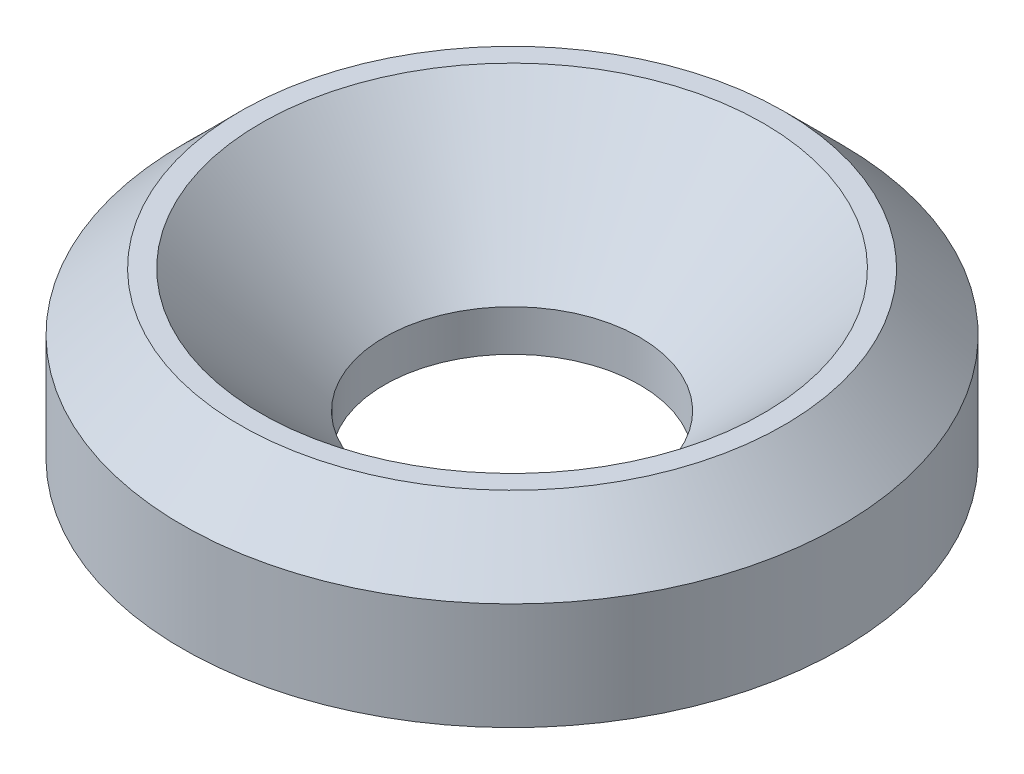
ISO-10303-21;
HEADER;
FILE_DESCRIPTION(('STEP AP214'),'2;1');
FILE_NAME('part.step','',(''),(''),'','','');
FILE_SCHEMA(('AUTOMOTIVE_DESIGN { 1 0 10303 214 1 1 1 1 }'));
ENDSEC;
DATA;
#1=APPLICATION_CONTEXT('core data for automotive mechanical design processes');
#2=APPLICATION_PROTOCOL_DEFINITION('international standard','automotive_design',2000,#1);
#3=PRODUCT_CONTEXT('',#1,'mechanical');
#4=PRODUCT('Part','Part','',(#3));
#5=PRODUCT_RELATED_PRODUCT_CATEGORY('part','',(#4));
#6=PRODUCT_DEFINITION_FORMATION('','',#4);
#7=PRODUCT_DEFINITION_CONTEXT('part definition',#1,'design');
#8=PRODUCT_DEFINITION('design','',#6,#7);
#9=PRODUCT_DEFINITION_SHAPE('','',#8);
#10=(LENGTH_UNIT() NAMED_UNIT(*) SI_UNIT(.MILLI.,.METRE.));
#11=(NAMED_UNIT(*) PLANE_ANGLE_UNIT() SI_UNIT($,.RADIAN.));
#12=(NAMED_UNIT(*) SI_UNIT($,.STERADIAN.) SOLID_ANGLE_UNIT());
#13=UNCERTAINTY_MEASURE_WITH_UNIT(LENGTH_MEASURE(1.E-05),#10,'distance_accuracy_value','');
#14=(GEOMETRIC_REPRESENTATION_CONTEXT(3) GLOBAL_UNCERTAINTY_ASSIGNED_CONTEXT((#13)) GLOBAL_UNIT_ASSIGNED_CONTEXT((#10,
#11,#12)) REPRESENTATION_CONTEXT('',''));
#15=CARTESIAN_POINT('',(0.,0.,0.));
#16=DIRECTION('',(0.,0.,1.));
#17=DIRECTION('',(1.,0.,0.));
#18=AXIS2_PLACEMENT_3D('',#15,#16,#17);
#19=CARTESIAN_POINT('',(1.55,0.,0.));
#20=DIRECTION('',(0.,-1.,0.));
#21=DIRECTION('',(0.,0.,-1.));
#22=AXIS2_PLACEMENT_3D('',#19,#20,#21);
#23=PLANE('',#22);
#24=CARTESIAN_POINT('',(0.,0.,0.));
#25=DIRECTION('',(0.,-1.,0.));
#26=DIRECTION('',(0.,0.,-1.));
#27=AXIS2_PLACEMENT_3D('',#24,#25,#26);
#28=CIRCLE('',#27,4.);
#29=CARTESIAN_POINT('',(0.,0.,-4.));
#30=VERTEX_POINT('',#29);
#31=EDGE_CURVE('E10',#30,#30,#28,.T.);
#32=ORIENTED_EDGE('',*,*,#31,.T.);
#33=EDGE_LOOP('',(#32));
#34=FACE_BOUND('',#33,.T.);
#35=CARTESIAN_POINT('',(0.,0.,0.));
#36=DIRECTION('',(0.,-1.,0.));
#37=DIRECTION('',(0.,0.,-1.));
#38=AXIS2_PLACEMENT_3D('',#35,#36,#37);
#39=CIRCLE('',#38,1.55);
#40=CARTESIAN_POINT('',(0.,0.,-1.55));
#41=VERTEX_POINT('',#40);
#42=EDGE_CURVE('E53',#41,#41,#39,.T.);
#43=ORIENTED_EDGE('',*,*,#42,.F.);
#44=EDGE_LOOP('',(#43));
#45=FACE_BOUND('',#44,.T.);
#46=ADVANCED_FACE('F31',(#34,#45),#23,.T.);
#47=CARTESIAN_POINT('',(0.,0.,0.));
#48=DIRECTION('',(0.,-1.,0.));
#49=DIRECTION('',(0.,0.,-1.));
#50=AXIS2_PLACEMENT_3D('',#47,#48,#49);
#51=CYLINDRICAL_SURFACE('',#50,4.);
#52=CARTESIAN_POINT('',(0.,1.3,0.));
#53=DIRECTION('',(0.,-1.,0.));
#54=DIRECTION('',(0.,0.,-1.));
#55=AXIS2_PLACEMENT_3D('',#52,#53,#54);
#56=CIRCLE('',#55,4.);
#57=CARTESIAN_POINT('',(0.,1.3,-4.));
#58=VERTEX_POINT('',#57);
#59=EDGE_CURVE('E37',#58,#58,#56,.T.);
#60=ORIENTED_EDGE('',*,*,#59,.T.);
#61=EDGE_LOOP('',(#60));
#62=FACE_BOUND('',#61,.T.);
#63=ORIENTED_EDGE('',*,*,#31,.F.);
#64=EDGE_LOOP('',(#63));
#65=FACE_BOUND('',#64,.T.);
#66=ADVANCED_FACE('F61',(#62,#65),#51,.T.);
#67=CARTESIAN_POINT('',(0.,1.3,0.));
#68=DIRECTION('',(0.,-1.,0.));
#69=DIRECTION('',(0.,0.,-1.));
#70=AXIS2_PLACEMENT_3D('',#67,#68,#69);
#71=CONICAL_SURFACE('',#70,4.,0.785398163397448);
#72=CARTESIAN_POINT('',(0.,2.,0.));
#73=DIRECTION('',(0.,-1.,0.));
#74=DIRECTION('',(0.,0.,-1.));
#75=AXIS2_PLACEMENT_3D('',#72,#73,#74);
#76=CIRCLE('',#75,3.3);
#77=CARTESIAN_POINT('',(0.,2.,-3.3));
#78=VERTEX_POINT('',#77);
#79=EDGE_CURVE('E41',#78,#78,#76,.T.);
#80=ORIENTED_EDGE('',*,*,#79,.T.);
#81=EDGE_LOOP('',(#80));
#82=FACE_BOUND('',#81,.T.);
#83=ORIENTED_EDGE('',*,*,#59,.F.);
#84=EDGE_LOOP('',(#83));
#85=FACE_BOUND('',#84,.T.);
#86=ADVANCED_FACE('F65',(#82,#85),#71,.T.);
#87=CARTESIAN_POINT('',(3.3,2.,0.));
#88=DIRECTION('',(0.,1.,0.));
#89=DIRECTION('',(0.,0.,1.));
#90=AXIS2_PLACEMENT_3D('',#87,#88,#89);
#91=PLANE('',#90);
#92=CARTESIAN_POINT('',(0.,2.,0.));
#93=DIRECTION('',(0.,-1.,0.));
#94=DIRECTION('',(0.,0.,-1.));
#95=AXIS2_PLACEMENT_3D('',#92,#93,#94);
#96=CIRCLE('',#95,3.05);
#97=CARTESIAN_POINT('',(0.,2.,-3.05));
#98=VERTEX_POINT('',#97);
#99=EDGE_CURVE('E45',#98,#98,#96,.T.);
#100=ORIENTED_EDGE('',*,*,#99,.T.);
#101=EDGE_LOOP('',(#100));
#102=FACE_BOUND('',#101,.T.);
#103=ORIENTED_EDGE('',*,*,#79,.F.);
#104=EDGE_LOOP('',(#103));
#105=FACE_BOUND('',#104,.T.);
#106=ADVANCED_FACE('F69',(#102,#105),#91,.T.);
#107=CARTESIAN_POINT('',(0.,2.,0.));
#108=DIRECTION('',(0.,1.,0.));
#109=DIRECTION('',(0.,0.,1.));
#110=AXIS2_PLACEMENT_3D('',#107,#108,#109);
#111=CONICAL_SURFACE('',#110,3.05,0.785398163397453);
#112=CARTESIAN_POINT('',(0.,0.500000000000016,0.));
#113=DIRECTION('',(0.,-1.,0.));
#114=DIRECTION('',(0.,0.,-1.));
#115=AXIS2_PLACEMENT_3D('',#112,#113,#114);
#116=CIRCLE('',#115,1.55);
#117=CARTESIAN_POINT('',(0.,0.500000000000016,-1.55));
#118=VERTEX_POINT('',#117);
#119=EDGE_CURVE('E50',#118,#118,#116,.T.);
#120=ORIENTED_EDGE('',*,*,#119,.T.);
#121=EDGE_LOOP('',(#120));
#122=FACE_BOUND('',#121,.T.);
#123=ORIENTED_EDGE('',*,*,#99,.F.);
#124=EDGE_LOOP('',(#123));
#125=FACE_BOUND('',#124,.T.);
#126=ADVANCED_FACE('F76',(#122,#125),#111,.F.);
#127=CARTESIAN_POINT('',(0.,0.,0.));
#128=DIRECTION('',(0.,-1.,0.));
#129=DIRECTION('',(0.,0.,-1.));
#130=AXIS2_PLACEMENT_3D('',#127,#128,#129);
#131=CYLINDRICAL_SURFACE('',#130,1.55);
#132=ORIENTED_EDGE('',*,*,#42,.T.);
#133=EDGE_LOOP('',(#132));
#134=FACE_BOUND('',#133,.T.);
#135=ORIENTED_EDGE('',*,*,#119,.F.);
#136=EDGE_LOOP('',(#135));
#137=FACE_BOUND('',#136,.T.);
#138=ADVANCED_FACE('F57',(#134,#137),#131,.F.);
#139=CLOSED_SHELL('',(#46,#66,#86,#106,#126,#138));
#140=MANIFOLD_SOLID_BREP('B2',#139);
#141=ADVANCED_BREP_SHAPE_REPRESENTATION('',(#18,#140),#14);
#142=SHAPE_DEFINITION_REPRESENTATION(#9,#141);
ENDSEC;
END-ISO-10303-21;
